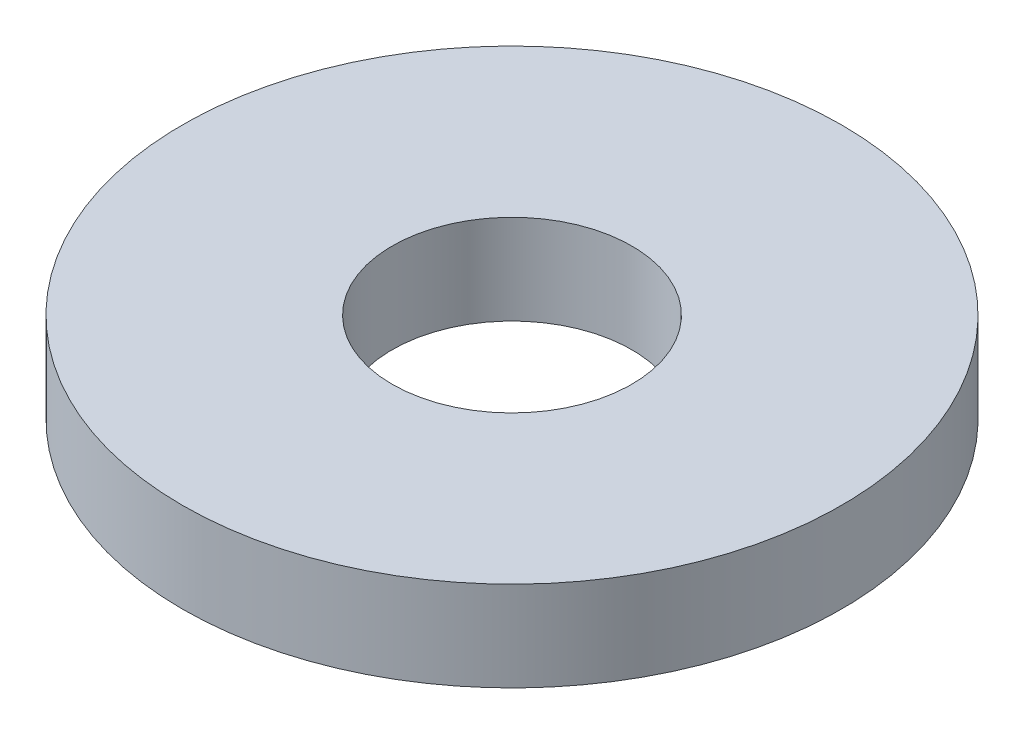
ISO-10303-21;
HEADER;
FILE_DESCRIPTION(('STEP AP214'),'2;1');
FILE_NAME('part.step','',(''),(''),'','','');
FILE_SCHEMA(('AUTOMOTIVE_DESIGN { 1 0 10303 214 1 1 1 1 }'));
ENDSEC;
DATA;
#1=APPLICATION_CONTEXT('core data for automotive mechanical design processes');
#2=APPLICATION_PROTOCOL_DEFINITION('international standard','automotive_design',2000,#1);
#3=PRODUCT_CONTEXT('',#1,'mechanical');
#4=PRODUCT('Part','Part','',(#3));
#5=PRODUCT_RELATED_PRODUCT_CATEGORY('part','',(#4));
#6=PRODUCT_DEFINITION_FORMATION('','',#4);
#7=PRODUCT_DEFINITION_CONTEXT('part definition',#1,'design');
#8=PRODUCT_DEFINITION('design','',#6,#7);
#9=PRODUCT_DEFINITION_SHAPE('','',#8);
#10=(LENGTH_UNIT() NAMED_UNIT(*) SI_UNIT(.MILLI.,.METRE.));
#11=(NAMED_UNIT(*) PLANE_ANGLE_UNIT() SI_UNIT($,.RADIAN.));
#12=(NAMED_UNIT(*) SI_UNIT($,.STERADIAN.) SOLID_ANGLE_UNIT());
#13=UNCERTAINTY_MEASURE_WITH_UNIT(LENGTH_MEASURE(1.E-05),#10,'distance_accuracy_value','');
#14=(GEOMETRIC_REPRESENTATION_CONTEXT(3) GLOBAL_UNCERTAINTY_ASSIGNED_CONTEXT((#13)) GLOBAL_UNIT_ASSIGNED_CONTEXT((#10,
#11,#12)) REPRESENTATION_CONTEXT('',''));
#15=CARTESIAN_POINT('',(0.,0.,0.));
#16=DIRECTION('',(0.,0.,1.));
#17=DIRECTION('',(1.,0.,0.));
#18=AXIS2_PLACEMENT_3D('',#15,#16,#17);
#19=CARTESIAN_POINT('',(0.,1.5,0.));
#20=DIRECTION('',(0.,-1.,0.));
#21=DIRECTION('',(0.,0.,-1.));
#22=AXIS2_PLACEMENT_3D('',#19,#20,#21);
#23=CYLINDRICAL_SURFACE('',#22,5.5);
#24=CARTESIAN_POINT('',(0.,1.5,0.));
#25=DIRECTION('',(0.,1.,0.));
#26=DIRECTION('',(0.,0.,1.));
#27=AXIS2_PLACEMENT_3D('',#24,#25,#26);
#28=CIRCLE('',#27,5.5);
#29=CARTESIAN_POINT('',(0.,1.5,5.5));
#30=VERTEX_POINT('',#29);
#31=EDGE_CURVE('E10',#30,#30,#28,.T.);
#32=ORIENTED_EDGE('',*,*,#31,.F.);
#33=EDGE_LOOP('',(#32));
#34=FACE_BOUND('',#33,.T.);
#35=CARTESIAN_POINT('',(0.,0.,0.));
#36=DIRECTION('',(0.,1.,0.));
#37=DIRECTION('',(0.,0.,1.));
#38=AXIS2_PLACEMENT_3D('',#35,#36,#37);
#39=CIRCLE('',#38,5.5);
#40=CARTESIAN_POINT('',(0.,0.,5.5));
#41=VERTEX_POINT('',#40);
#42=EDGE_CURVE('E33',#41,#41,#39,.T.);
#43=ORIENTED_EDGE('',*,*,#42,.T.);
#44=EDGE_LOOP('',(#43));
#45=FACE_BOUND('',#44,.T.);
#46=ADVANCED_FACE('F30',(#34,#45),#23,.T.);
#47=CARTESIAN_POINT('',(0.,1.5,0.));
#48=DIRECTION('',(0.,1.,0.));
#49=DIRECTION('',(0.,0.,1.));
#50=AXIS2_PLACEMENT_3D('',#47,#48,#49);
#51=PLANE('',#50);
#52=CARTESIAN_POINT('',(0.,1.5,0.));
#53=DIRECTION('',(0.,1.,0.));
#54=DIRECTION('',(0.,0.,1.));
#55=AXIS2_PLACEMENT_3D('',#52,#53,#54);
#56=CIRCLE('',#55,2.);
#57=CARTESIAN_POINT('',(0.,1.5,2.));
#58=VERTEX_POINT('',#57);
#59=EDGE_CURVE('E42',#58,#58,#56,.T.);
#60=ORIENTED_EDGE('',*,*,#59,.F.);
#61=EDGE_LOOP('',(#60));
#62=FACE_BOUND('',#61,.T.);
#63=ORIENTED_EDGE('',*,*,#31,.T.);
#64=EDGE_LOOP('',(#63));
#65=FACE_BOUND('',#64,.T.);
#66=ADVANCED_FACE('F57',(#62,#65),#51,.T.);
#67=CARTESIAN_POINT('',(0.,0.,0.));
#68=DIRECTION('',(0.,1.,0.));
#69=DIRECTION('',(0.,0.,1.));
#70=AXIS2_PLACEMENT_3D('',#67,#68,#69);
#71=PLANE('',#70);
#72=CARTESIAN_POINT('',(0.,0.,0.));
#73=DIRECTION('',(0.,1.,0.));
#74=DIRECTION('',(0.,0.,1.));
#75=AXIS2_PLACEMENT_3D('',#72,#73,#74);
#76=CIRCLE('',#75,2.);
#77=CARTESIAN_POINT('',(0.,0.,2.));
#78=VERTEX_POINT('',#77);
#79=EDGE_CURVE('E40',#78,#78,#76,.T.);
#80=ORIENTED_EDGE('',*,*,#79,.T.);
#81=EDGE_LOOP('',(#80));
#82=FACE_BOUND('',#81,.T.);
#83=ORIENTED_EDGE('',*,*,#42,.F.);
#84=EDGE_LOOP('',(#83));
#85=FACE_BOUND('',#84,.T.);
#86=ADVANCED_FACE('F48',(#82,#85),#71,.F.);
#87=CARTESIAN_POINT('',(0.,0.,0.));
#88=DIRECTION('',(0.,1.,0.));
#89=DIRECTION('',(0.,0.,1.));
#90=AXIS2_PLACEMENT_3D('',#87,#88,#89);
#91=CYLINDRICAL_SURFACE('',#90,2.);
#92=ORIENTED_EDGE('',*,*,#79,.F.);
#93=EDGE_LOOP('',(#92));
#94=FACE_BOUND('',#93,.T.);
#95=ORIENTED_EDGE('',*,*,#59,.T.);
#96=EDGE_LOOP('',(#95));
#97=FACE_BOUND('',#96,.T.);
#98=ADVANCED_FACE('F51',(#94,#97),#91,.F.);
#99=CLOSED_SHELL('',(#46,#66,#86,#98));
#100=MANIFOLD_SOLID_BREP('B2',#99);
#101=ADVANCED_BREP_SHAPE_REPRESENTATION('',(#18,#100),#14);
#102=SHAPE_DEFINITION_REPRESENTATION(#9,#101);
ENDSEC;
END-ISO-10303-21;
